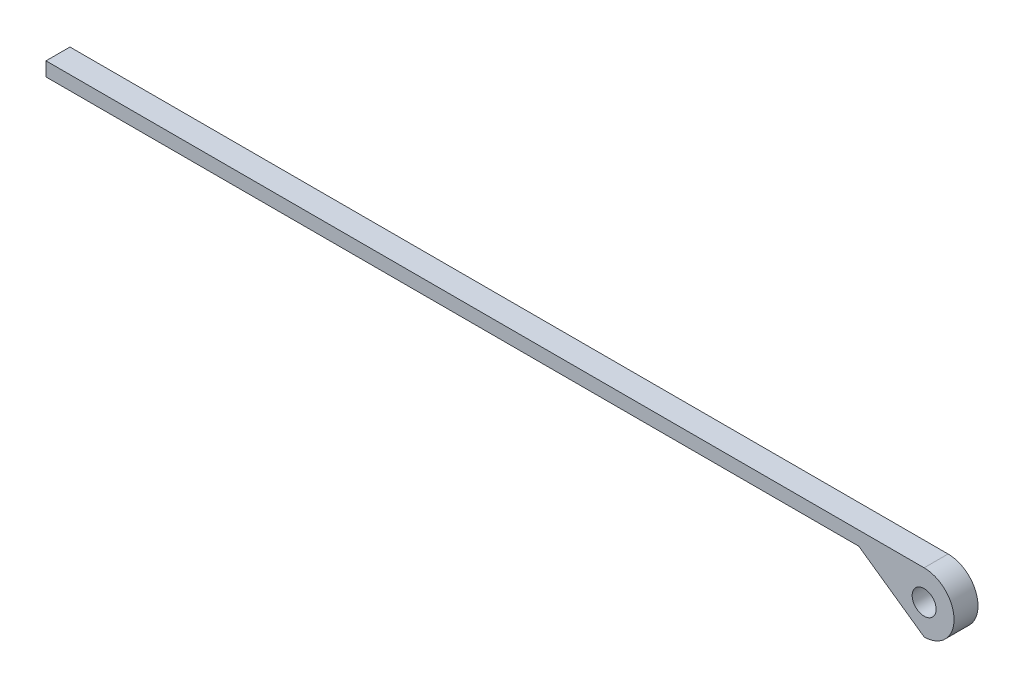
ISO-10303-21;
HEADER;
FILE_DESCRIPTION(('STEP AP214'),'2;1');
FILE_NAME('part.step','',(''),(''),'','','');
FILE_SCHEMA(('AUTOMOTIVE_DESIGN { 1 0 10303 214 1 1 1 1 }'));
ENDSEC;
DATA;
#1=APPLICATION_CONTEXT('core data for automotive mechanical design processes');
#2=APPLICATION_PROTOCOL_DEFINITION('international standard','automotive_design',2000,#1);
#3=PRODUCT_CONTEXT('',#1,'mechanical');
#4=PRODUCT('Part','Part','',(#3));
#5=PRODUCT_RELATED_PRODUCT_CATEGORY('part','',(#4));
#6=PRODUCT_DEFINITION_FORMATION('','',#4);
#7=PRODUCT_DEFINITION_CONTEXT('part definition',#1,'design');
#8=PRODUCT_DEFINITION('design','',#6,#7);
#9=PRODUCT_DEFINITION_SHAPE('','',#8);
#10=(LENGTH_UNIT() NAMED_UNIT(*) SI_UNIT(.MILLI.,.METRE.));
#11=(NAMED_UNIT(*) PLANE_ANGLE_UNIT() SI_UNIT($,.RADIAN.));
#12=(NAMED_UNIT(*) SI_UNIT($,.STERADIAN.) SOLID_ANGLE_UNIT());
#13=UNCERTAINTY_MEASURE_WITH_UNIT(LENGTH_MEASURE(1.E-05),#10,'distance_accuracy_value','');
#14=(GEOMETRIC_REPRESENTATION_CONTEXT(3) GLOBAL_UNCERTAINTY_ASSIGNED_CONTEXT((#13)) GLOBAL_UNIT_ASSIGNED_CONTEXT((#10,
#11,#12)) REPRESENTATION_CONTEXT('',''));
#15=CARTESIAN_POINT('',(0.,0.,0.));
#16=DIRECTION('',(0.,0.,1.));
#17=DIRECTION('',(1.,0.,0.));
#18=AXIS2_PLACEMENT_3D('',#15,#16,#17);
#19=CARTESIAN_POINT('',(210.,392.30607249682,6.));
#20=DIRECTION('',(0.,0.,1.));
#21=DIRECTION('',(1.,0.,0.));
#22=AXIS2_PLACEMENT_3D('',#19,#20,#21);
#23=PLANE('',#22);
#24=CARTESIAN_POINT('',(210.,392.30607249682,6.));
#25=DIRECTION('',(0.,0.,1.));
#26=DIRECTION('',(1.,0.,0.));
#27=AXIS2_PLACEMENT_3D('',#24,#25,#26);
#28=CIRCLE('',#27,7.50000000000001);
#29=CARTESIAN_POINT('',(210.,384.80607249682,6.));
#30=VERTEX_POINT('',#29);
#31=CARTESIAN_POINT('',(210.,399.80607249682,6.));
#32=VERTEX_POINT('',#31);
#33=EDGE_CURVE('E119',#30,#32,#28,.T.);
#34=ORIENTED_EDGE('',*,*,#33,.T.);
#35=DIRECTION('',(-1.,0.,0.));
#36=VECTOR('',#35,1.);
#37=CARTESIAN_POINT('',(210.,399.80607249682,6.));
#38=LINE('',#37,#36);
#39=CARTESIAN_POINT('',(-10.,399.80607249682,6.));
#40=VERTEX_POINT('',#39);
#41=EDGE_CURVE('E86',#32,#40,#38,.T.);
#42=ORIENTED_EDGE('',*,*,#41,.T.);
#43=DIRECTION('',(0.,-1.,0.));
#44=VECTOR('',#43,1.);
#45=CARTESIAN_POINT('',(-10.,399.80607249682,6.));
#46=LINE('',#45,#44);
#47=CARTESIAN_POINT('',(-10.,396.30607249682,6.));
#48=VERTEX_POINT('',#47);
#49=EDGE_CURVE('E90',#40,#48,#46,.T.);
#50=ORIENTED_EDGE('',*,*,#49,.T.);
#51=DIRECTION('',(1.,0.,0.));
#52=VECTOR('',#51,1.);
#53=CARTESIAN_POINT('',(-10.,396.30607249682,6.));
#54=LINE('',#53,#52);
#55=CARTESIAN_POINT('',(193.636931828046,396.30607249682,6.));
#56=VERTEX_POINT('',#55);
#57=EDGE_CURVE('E94',#48,#56,#54,.T.);
#58=ORIENTED_EDGE('',*,*,#57,.T.);
#59=DIRECTION('',(0.818153408597678,-0.575,0.));
#60=VECTOR('',#59,1.);
#61=CARTESIAN_POINT('',(193.636931828046,396.30607249682,6.));
#62=LINE('',#61,#60);
#63=EDGE_CURVE('E52',#56,#30,#62,.T.);
#64=ORIENTED_EDGE('',*,*,#63,.T.);
#65=EDGE_LOOP('',(#34,#42,#50,#58,#64));
#66=FACE_BOUND('',#65,.T.);
#67=CARTESIAN_POINT('',(210.,392.30607249682,6.));
#68=DIRECTION('',(0.,0.,1.));
#69=DIRECTION('',(1.,0.,0.));
#70=AXIS2_PLACEMENT_3D('',#67,#68,#69);
#71=CIRCLE('',#70,2.99999999999999);
#72=CARTESIAN_POINT('',(213.,392.30607249682,6.));
#73=VERTEX_POINT('',#72);
#74=EDGE_CURVE('E114',#73,#73,#71,.T.);
#75=ORIENTED_EDGE('',*,*,#74,.F.);
#76=EDGE_LOOP('',(#75));
#77=FACE_BOUND('',#76,.T.);
#78=ADVANCED_FACE('F35',(#66,#77),#23,.T.);
#79=CARTESIAN_POINT('',(210.,392.30607249682,0.));
#80=DIRECTION('',(0.,0.,1.));
#81=DIRECTION('',(1.,0.,0.));
#82=AXIS2_PLACEMENT_3D('',#79,#80,#81);
#83=PLANE('',#82);
#84=CARTESIAN_POINT('',(210.,392.30607249682,0.));
#85=DIRECTION('',(0.,0.,1.));
#86=DIRECTION('',(1.,0.,0.));
#87=AXIS2_PLACEMENT_3D('',#84,#85,#86);
#88=CIRCLE('',#87,7.50000000000001);
#89=CARTESIAN_POINT('',(210.,384.80607249682,0.));
#90=VERTEX_POINT('',#89);
#91=CARTESIAN_POINT('',(210.,399.80607249682,0.));
#92=VERTEX_POINT('',#91);
#93=EDGE_CURVE('E110',#90,#92,#88,.T.);
#94=ORIENTED_EDGE('',*,*,#93,.F.);
#95=DIRECTION('',(0.818153408597678,-0.575,0.));
#96=VECTOR('',#95,1.);
#97=CARTESIAN_POINT('',(193.636931828046,396.30607249682,0.));
#98=LINE('',#97,#96);
#99=CARTESIAN_POINT('',(193.636931828046,396.30607249682,0.));
#100=VERTEX_POINT('',#99);
#101=EDGE_CURVE('E78',#100,#90,#98,.T.);
#102=ORIENTED_EDGE('',*,*,#101,.F.);
#103=DIRECTION('',(1.,0.,0.));
#104=VECTOR('',#103,1.);
#105=CARTESIAN_POINT('',(-10.,396.30607249682,0.));
#106=LINE('',#105,#104);
#107=CARTESIAN_POINT('',(-10.,396.30607249682,0.));
#108=VERTEX_POINT('',#107);
#109=EDGE_CURVE('E72',#108,#100,#106,.T.);
#110=ORIENTED_EDGE('',*,*,#109,.F.);
#111=DIRECTION('',(0.,-1.,0.));
#112=VECTOR('',#111,1.);
#113=CARTESIAN_POINT('',(-10.,399.80607249682,0.));
#114=LINE('',#113,#112);
#115=CARTESIAN_POINT('',(-10.,399.80607249682,0.));
#116=VERTEX_POINT('',#115);
#117=EDGE_CURVE('E101',#116,#108,#114,.T.);
#118=ORIENTED_EDGE('',*,*,#117,.F.);
#119=DIRECTION('',(-1.,0.,0.));
#120=VECTOR('',#119,1.);
#121=CARTESIAN_POINT('',(210.,399.80607249682,0.));
#122=LINE('',#121,#120);
#123=EDGE_CURVE('E113',#92,#116,#122,.T.);
#124=ORIENTED_EDGE('',*,*,#123,.F.);
#125=EDGE_LOOP('',(#94,#102,#110,#118,#124));
#126=FACE_BOUND('',#125,.T.);
#127=CARTESIAN_POINT('',(210.,392.30607249682,0.));
#128=DIRECTION('',(0.,0.,1.));
#129=DIRECTION('',(1.,0.,0.));
#130=AXIS2_PLACEMENT_3D('',#127,#128,#129);
#131=CIRCLE('',#130,2.99999999999999);
#132=CARTESIAN_POINT('',(213.,392.30607249682,0.));
#133=VERTEX_POINT('',#132);
#134=EDGE_CURVE('E199',#133,#133,#131,.T.);
#135=ORIENTED_EDGE('',*,*,#134,.T.);
#136=EDGE_LOOP('',(#135));
#137=FACE_BOUND('',#136,.T.);
#138=ADVANCED_FACE('F123',(#126,#137),#83,.F.);
#139=CARTESIAN_POINT('',(210.,392.30607249682,6.));
#140=DIRECTION('',(0.,0.,-1.));
#141=DIRECTION('',(-1.,0.,0.));
#142=AXIS2_PLACEMENT_3D('',#139,#140,#141);
#143=CYLINDRICAL_SURFACE('',#142,7.50000000000001);
#144=ORIENTED_EDGE('',*,*,#93,.T.);
#145=DIRECTION('',(0.,0.,-1.));
#146=VECTOR('',#145,1.);
#147=CARTESIAN_POINT('',(210.,399.80607249682,6.));
#148=LINE('',#147,#146);
#149=EDGE_CURVE('E11',#32,#92,#148,.T.);
#150=ORIENTED_EDGE('',*,*,#149,.F.);
#151=ORIENTED_EDGE('',*,*,#33,.F.);
#152=DIRECTION('',(0.,0.,-1.));
#153=VECTOR('',#152,1.);
#154=CARTESIAN_POINT('',(210.,384.80607249682,6.));
#155=LINE('',#154,#153);
#156=EDGE_CURVE('E106',#30,#90,#155,.T.);
#157=ORIENTED_EDGE('',*,*,#156,.T.);
#158=EDGE_LOOP('',(#144,#150,#151,#157));
#159=FACE_BOUND('',#158,.T.);
#160=ADVANCED_FACE('F37',(#159),#143,.T.);
#161=CARTESIAN_POINT('',(210.,399.80607249682,6.));
#162=DIRECTION('',(0.,-1.,0.));
#163=DIRECTION('',(0.,0.,-1.));
#164=AXIS2_PLACEMENT_3D('',#161,#162,#163);
#165=PLANE('',#164);
#166=ORIENTED_EDGE('',*,*,#123,.T.);
#167=DIRECTION('',(0.,0.,-1.));
#168=VECTOR('',#167,1.);
#169=CARTESIAN_POINT('',(-10.,399.80607249682,6.));
#170=LINE('',#169,#168);
#171=EDGE_CURVE('E44',#40,#116,#170,.T.);
#172=ORIENTED_EDGE('',*,*,#171,.F.);
#173=ORIENTED_EDGE('',*,*,#41,.F.);
#174=ORIENTED_EDGE('',*,*,#149,.T.);
#175=EDGE_LOOP('',(#166,#172,#173,#174));
#176=FACE_BOUND('',#175,.T.);
#177=ADVANCED_FACE('F148',(#176),#165,.F.);
#178=CARTESIAN_POINT('',(-10.,399.80607249682,6.));
#179=DIRECTION('',(1.,0.,0.));
#180=DIRECTION('',(0.,0.,-1.));
#181=AXIS2_PLACEMENT_3D('',#178,#179,#180);
#182=PLANE('',#181);
#183=ORIENTED_EDGE('',*,*,#117,.T.);
#184=DIRECTION('',(0.,0.,-1.));
#185=VECTOR('',#184,1.);
#186=CARTESIAN_POINT('',(-10.,396.30607249682,6.));
#187=LINE('',#186,#185);
#188=EDGE_CURVE('E98',#48,#108,#187,.T.);
#189=ORIENTED_EDGE('',*,*,#188,.F.);
#190=ORIENTED_EDGE('',*,*,#49,.F.);
#191=ORIENTED_EDGE('',*,*,#171,.T.);
#192=EDGE_LOOP('',(#183,#189,#190,#191));
#193=FACE_BOUND('',#192,.T.);
#194=ADVANCED_FACE('F99',(#193),#182,.F.);
#195=CARTESIAN_POINT('',(-10.,396.30607249682,6.));
#196=DIRECTION('',(0.,1.,0.));
#197=DIRECTION('',(0.,0.,1.));
#198=AXIS2_PLACEMENT_3D('',#195,#196,#197);
#199=PLANE('',#198);
#200=ORIENTED_EDGE('',*,*,#109,.T.);
#201=DIRECTION('',(0.,0.,-1.));
#202=VECTOR('',#201,1.);
#203=CARTESIAN_POINT('',(193.636931828046,396.30607249682,6.));
#204=LINE('',#203,#202);
#205=EDGE_CURVE('E102',#56,#100,#204,.T.);
#206=ORIENTED_EDGE('',*,*,#205,.F.);
#207=ORIENTED_EDGE('',*,*,#57,.F.);
#208=ORIENTED_EDGE('',*,*,#188,.T.);
#209=EDGE_LOOP('',(#200,#206,#207,#208));
#210=FACE_BOUND('',#209,.T.);
#211=ADVANCED_FACE('F104',(#210),#199,.F.);
#212=CARTESIAN_POINT('',(193.636931828046,396.30607249682,6.));
#213=DIRECTION('',(0.575,0.818153408597678,0.));
#214=DIRECTION('',(-0.818153408597678,0.575,0.));
#215=AXIS2_PLACEMENT_3D('',#212,#213,#214);
#216=PLANE('',#215);
#217=ORIENTED_EDGE('',*,*,#101,.T.);
#218=ORIENTED_EDGE('',*,*,#156,.F.);
#219=ORIENTED_EDGE('',*,*,#63,.F.);
#220=ORIENTED_EDGE('',*,*,#205,.T.);
#221=EDGE_LOOP('',(#217,#218,#219,#220));
#222=FACE_BOUND('',#221,.T.);
#223=ADVANCED_FACE('F128',(#222),#216,.F.);
#224=CARTESIAN_POINT('',(210.,392.30607249682,6.));
#225=DIRECTION('',(0.,0.,-1.));
#226=DIRECTION('',(-1.,0.,0.));
#227=AXIS2_PLACEMENT_3D('',#224,#225,#226);
#228=CYLINDRICAL_SURFACE('',#227,2.99999999999999);
#229=ORIENTED_EDGE('',*,*,#74,.T.);
#230=EDGE_LOOP('',(#229));
#231=FACE_BOUND('',#230,.T.);
#232=ORIENTED_EDGE('',*,*,#134,.F.);
#233=EDGE_LOOP('',(#232));
#234=FACE_BOUND('',#233,.T.);
#235=ADVANCED_FACE('F130',(#231,#234),#228,.F.);
#236=CLOSED_SHELL('',(#78,#138,#160,#177,#194,#211,#223,#235));
#237=MANIFOLD_SOLID_BREP('B2',#236);
#238=ADVANCED_BREP_SHAPE_REPRESENTATION('',(#18,#237),#14);
#239=SHAPE_DEFINITION_REPRESENTATION(#9,#238);
ENDSEC;
END-ISO-10303-21;
